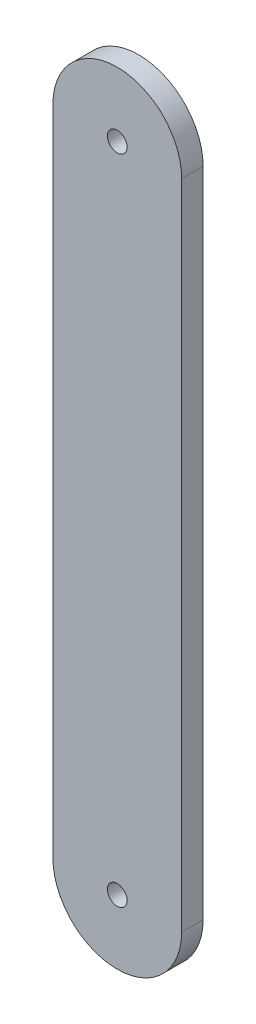
ISO-10303-21;
HEADER;
FILE_DESCRIPTION(('STEP AP214'),'2;1');
FILE_NAME('part.step','',(''),(''),'','','');
FILE_SCHEMA(('AUTOMOTIVE_DESIGN { 1 0 10303 214 1 1 1 1 }'));
ENDSEC;
DATA;
#1=APPLICATION_CONTEXT('core data for automotive mechanical design processes');
#2=APPLICATION_PROTOCOL_DEFINITION('international standard','automotive_design',2000,#1);
#3=PRODUCT_CONTEXT('',#1,'mechanical');
#4=PRODUCT('Part','Part','',(#3));
#5=PRODUCT_RELATED_PRODUCT_CATEGORY('part','',(#4));
#6=PRODUCT_DEFINITION_FORMATION('','',#4);
#7=PRODUCT_DEFINITION_CONTEXT('part definition',#1,'design');
#8=PRODUCT_DEFINITION('design','',#6,#7);
#9=PRODUCT_DEFINITION_SHAPE('','',#8);
#10=(LENGTH_UNIT() NAMED_UNIT(*) SI_UNIT(.MILLI.,.METRE.));
#11=(NAMED_UNIT(*) PLANE_ANGLE_UNIT() SI_UNIT($,.RADIAN.));
#12=(NAMED_UNIT(*) SI_UNIT($,.STERADIAN.) SOLID_ANGLE_UNIT());
#13=UNCERTAINTY_MEASURE_WITH_UNIT(LENGTH_MEASURE(1.E-05),#10,'distance_accuracy_value','');
#14=(GEOMETRIC_REPRESENTATION_CONTEXT(3) GLOBAL_UNCERTAINTY_ASSIGNED_CONTEXT((#13)) GLOBAL_UNIT_ASSIGNED_CONTEXT((#10,
#11,#12)) REPRESENTATION_CONTEXT('',''));
#15=CARTESIAN_POINT('',(0.,0.,0.));
#16=DIRECTION('',(0.,0.,1.));
#17=DIRECTION('',(1.,0.,0.));
#18=AXIS2_PLACEMENT_3D('',#15,#16,#17);
#19=CARTESIAN_POINT('',(-9.82801288749565,0.,3.175));
#20=DIRECTION('',(0.,0.,1.));
#21=DIRECTION('',(1.,0.,0.));
#22=AXIS2_PLACEMENT_3D('',#19,#20,#21);
#23=PLANE('',#22);
#24=CARTESIAN_POINT('',(-9.82801288749566,96.52,3.175));
#25=DIRECTION('',(0.,0.,1.));
#26=DIRECTION('',(1.,0.,0.));
#27=AXIS2_PLACEMENT_3D('',#24,#25,#26);
#28=CIRCLE('',#27,1.4605);
#29=CARTESIAN_POINT('',(-8.36751288749566,96.52,3.175));
#30=VERTEX_POINT('',#29);
#31=EDGE_CURVE('E100',#30,#30,#28,.T.);
#32=ORIENTED_EDGE('',*,*,#31,.F.);
#33=EDGE_LOOP('',(#32));
#34=FACE_BOUND('',#33,.T.);
#35=CARTESIAN_POINT('',(-9.82801288749565,0.,3.175));
#36=DIRECTION('',(0.,0.,1.));
#37=DIRECTION('',(1.,0.,0.));
#38=AXIS2_PLACEMENT_3D('',#35,#36,#37);
#39=CIRCLE('',#38,9.525);
#40=CARTESIAN_POINT('',(-19.3530128874956,0.,3.175));
#41=VERTEX_POINT('',#40);
#42=CARTESIAN_POINT('',(-0.30301288749565,0.,3.175));
#43=VERTEX_POINT('',#42);
#44=EDGE_CURVE('E85',#41,#43,#39,.T.);
#45=ORIENTED_EDGE('',*,*,#44,.T.);
#46=DIRECTION('',(0.,1.,0.));
#47=VECTOR('',#46,1.);
#48=CARTESIAN_POINT('',(-0.303012887495662,96.52,3.175));
#49=LINE('',#48,#47);
#50=CARTESIAN_POINT('',(-0.303012887495662,96.52,3.175));
#51=VERTEX_POINT('',#50);
#52=EDGE_CURVE('E80',#43,#51,#49,.T.);
#53=ORIENTED_EDGE('',*,*,#52,.T.);
#54=CARTESIAN_POINT('',(-9.82801288749566,96.52,3.175));
#55=DIRECTION('',(0.,0.,1.));
#56=DIRECTION('',(-1.,0.,0.));
#57=AXIS2_PLACEMENT_3D('',#54,#55,#56);
#58=CIRCLE('',#57,9.525);
#59=CARTESIAN_POINT('',(-19.3530128874957,96.52,3.175));
#60=VERTEX_POINT('',#59);
#61=EDGE_CURVE('E83',#51,#60,#58,.T.);
#62=ORIENTED_EDGE('',*,*,#61,.T.);
#63=DIRECTION('',(0.,-1.,0.));
#64=VECTOR('',#63,1.);
#65=CARTESIAN_POINT('',(-19.3530128874956,0.,3.175));
#66=LINE('',#65,#64);
#67=EDGE_CURVE('E50',#60,#41,#66,.T.);
#68=ORIENTED_EDGE('',*,*,#67,.T.);
#69=EDGE_LOOP('',(#45,#53,#62,#68));
#70=FACE_BOUND('',#69,.T.);
#71=CARTESIAN_POINT('',(-9.82801288749565,0.,3.175));
#72=DIRECTION('',(0.,0.,1.));
#73=DIRECTION('',(1.,0.,0.));
#74=AXIS2_PLACEMENT_3D('',#71,#72,#73);
#75=CIRCLE('',#74,1.4605);
#76=CARTESIAN_POINT('',(-8.36751288749565,0.,3.175));
#77=VERTEX_POINT('',#76);
#78=EDGE_CURVE('E115',#77,#77,#75,.T.);
#79=ORIENTED_EDGE('',*,*,#78,.F.);
#80=EDGE_LOOP('',(#79));
#81=FACE_BOUND('',#80,.T.);
#82=ADVANCED_FACE('F33',(#34,#70,#81),#23,.T.);
#83=CARTESIAN_POINT('',(-9.82801288749565,0.,0.));
#84=DIRECTION('',(0.,0.,1.));
#85=DIRECTION('',(1.,0.,0.));
#86=AXIS2_PLACEMENT_3D('',#83,#84,#85);
#87=PLANE('',#86);
#88=CARTESIAN_POINT('',(-9.82801288749565,0.,0.));
#89=DIRECTION('',(0.,0.,1.));
#90=DIRECTION('',(1.,0.,0.));
#91=AXIS2_PLACEMENT_3D('',#88,#89,#90);
#92=CIRCLE('',#91,9.525);
#93=CARTESIAN_POINT('',(-19.3530128874956,0.,0.));
#94=VERTEX_POINT('',#93);
#95=CARTESIAN_POINT('',(-0.30301288749565,0.,0.));
#96=VERTEX_POINT('',#95);
#97=EDGE_CURVE('E97',#94,#96,#92,.T.);
#98=ORIENTED_EDGE('',*,*,#97,.F.);
#99=DIRECTION('',(0.,-1.,0.));
#100=VECTOR('',#99,1.);
#101=CARTESIAN_POINT('',(-19.3530128874956,0.,0.));
#102=LINE('',#101,#100);
#103=CARTESIAN_POINT('',(-19.3530128874957,96.52,0.));
#104=VERTEX_POINT('',#103);
#105=EDGE_CURVE('E73',#104,#94,#102,.T.);
#106=ORIENTED_EDGE('',*,*,#105,.F.);
#107=CARTESIAN_POINT('',(-9.82801288749566,96.52,0.));
#108=DIRECTION('',(0.,0.,1.));
#109=DIRECTION('',(-1.,0.,0.));
#110=AXIS2_PLACEMENT_3D('',#107,#108,#109);
#111=CIRCLE('',#110,9.525);
#112=CARTESIAN_POINT('',(-0.303012887495662,96.52,0.));
#113=VERTEX_POINT('',#112);
#114=EDGE_CURVE('E67',#113,#104,#111,.T.);
#115=ORIENTED_EDGE('',*,*,#114,.F.);
#116=DIRECTION('',(0.,1.,0.));
#117=VECTOR('',#116,1.);
#118=CARTESIAN_POINT('',(-0.303012887495662,96.52,0.));
#119=LINE('',#118,#117);
#120=EDGE_CURVE('E89',#96,#113,#119,.T.);
#121=ORIENTED_EDGE('',*,*,#120,.F.);
#122=EDGE_LOOP('',(#98,#106,#115,#121));
#123=FACE_BOUND('',#122,.T.);
#124=CARTESIAN_POINT('',(-9.82801288749566,96.52,0.));
#125=DIRECTION('',(0.,0.,1.));
#126=DIRECTION('',(1.,0.,0.));
#127=AXIS2_PLACEMENT_3D('',#124,#125,#126);
#128=CIRCLE('',#127,1.4605);
#129=CARTESIAN_POINT('',(-8.36751288749566,96.52,0.));
#130=VERTEX_POINT('',#129);
#131=EDGE_CURVE('E112',#130,#130,#128,.T.);
#132=ORIENTED_EDGE('',*,*,#131,.T.);
#133=EDGE_LOOP('',(#132));
#134=FACE_BOUND('',#133,.T.);
#135=CARTESIAN_POINT('',(-9.82801288749565,0.,0.));
#136=DIRECTION('',(0.,0.,1.));
#137=DIRECTION('',(1.,0.,0.));
#138=AXIS2_PLACEMENT_3D('',#135,#136,#137);
#139=CIRCLE('',#138,1.4605);
#140=CARTESIAN_POINT('',(-8.36751288749565,0.,0.));
#141=VERTEX_POINT('',#140);
#142=EDGE_CURVE('E118',#141,#141,#139,.T.);
#143=ORIENTED_EDGE('',*,*,#142,.T.);
#144=EDGE_LOOP('',(#143));
#145=FACE_BOUND('',#144,.T.);
#146=ADVANCED_FACE('F108',(#123,#134,#145),#87,.F.);
#147=CARTESIAN_POINT('',(-9.82801288749565,0.,3.175));
#148=DIRECTION('',(0.,0.,-1.));
#149=DIRECTION('',(-1.,0.,0.));
#150=AXIS2_PLACEMENT_3D('',#147,#148,#149);
#151=CYLINDRICAL_SURFACE('',#150,9.525);
#152=ORIENTED_EDGE('',*,*,#97,.T.);
#153=DIRECTION('',(0.,0.,-1.));
#154=VECTOR('',#153,1.);
#155=CARTESIAN_POINT('',(-0.30301288749565,0.,3.175));
#156=LINE('',#155,#154);
#157=EDGE_CURVE('E11',#43,#96,#156,.T.);
#158=ORIENTED_EDGE('',*,*,#157,.F.);
#159=ORIENTED_EDGE('',*,*,#44,.F.);
#160=DIRECTION('',(0.,0.,-1.));
#161=VECTOR('',#160,1.);
#162=CARTESIAN_POINT('',(-19.3530128874956,0.,3.175));
#163=LINE('',#162,#161);
#164=EDGE_CURVE('E93',#41,#94,#163,.T.);
#165=ORIENTED_EDGE('',*,*,#164,.T.);
#166=EDGE_LOOP('',(#152,#158,#159,#165));
#167=FACE_BOUND('',#166,.T.);
#168=ADVANCED_FACE('F35',(#167),#151,.T.);
#169=CARTESIAN_POINT('',(-0.303012887495662,96.52,3.175));
#170=DIRECTION('',(-1.,0.,0.));
#171=DIRECTION('',(0.,-1.,0.));
#172=AXIS2_PLACEMENT_3D('',#169,#170,#171);
#173=PLANE('',#172);
#174=ORIENTED_EDGE('',*,*,#120,.T.);
#175=DIRECTION('',(0.,0.,-1.));
#176=VECTOR('',#175,1.);
#177=CARTESIAN_POINT('',(-0.303012887495662,96.52,3.175));
#178=LINE('',#177,#176);
#179=EDGE_CURVE('E42',#51,#113,#178,.T.);
#180=ORIENTED_EDGE('',*,*,#179,.F.);
#181=ORIENTED_EDGE('',*,*,#52,.F.);
#182=ORIENTED_EDGE('',*,*,#157,.T.);
#183=EDGE_LOOP('',(#174,#180,#181,#182));
#184=FACE_BOUND('',#183,.T.);
#185=ADVANCED_FACE('F88',(#184),#173,.F.);
#186=CARTESIAN_POINT('',(-9.82801288749566,96.52,3.175));
#187=DIRECTION('',(0.,0.,-1.));
#188=DIRECTION('',(-1.,0.,0.));
#189=AXIS2_PLACEMENT_3D('',#186,#187,#188);
#190=CYLINDRICAL_SURFACE('',#189,9.525);
#191=ORIENTED_EDGE('',*,*,#114,.T.);
#192=DIRECTION('',(0.,0.,-1.));
#193=VECTOR('',#192,1.);
#194=CARTESIAN_POINT('',(-19.3530128874957,96.52,3.175));
#195=LINE('',#194,#193);
#196=EDGE_CURVE('E90',#60,#104,#195,.T.);
#197=ORIENTED_EDGE('',*,*,#196,.F.);
#198=ORIENTED_EDGE('',*,*,#61,.F.);
#199=ORIENTED_EDGE('',*,*,#179,.T.);
#200=EDGE_LOOP('',(#191,#197,#198,#199));
#201=FACE_BOUND('',#200,.T.);
#202=ADVANCED_FACE('F91',(#201),#190,.T.);
#203=CARTESIAN_POINT('',(-19.3530128874956,0.,3.175));
#204=DIRECTION('',(1.,0.,0.));
#205=DIRECTION('',(0.,1.,0.));
#206=AXIS2_PLACEMENT_3D('',#203,#204,#205);
#207=PLANE('',#206);
#208=ORIENTED_EDGE('',*,*,#105,.T.);
#209=ORIENTED_EDGE('',*,*,#164,.F.);
#210=ORIENTED_EDGE('',*,*,#67,.F.);
#211=ORIENTED_EDGE('',*,*,#196,.T.);
#212=EDGE_LOOP('',(#208,#209,#210,#211));
#213=FACE_BOUND('',#212,.T.);
#214=ADVANCED_FACE('F105',(#213),#207,.F.);
#215=CARTESIAN_POINT('',(-9.82801288749566,96.52,3.175));
#216=DIRECTION('',(0.,0.,-1.));
#217=DIRECTION('',(-1.,0.,0.));
#218=AXIS2_PLACEMENT_3D('',#215,#216,#217);
#219=CYLINDRICAL_SURFACE('',#218,1.4605);
#220=ORIENTED_EDGE('',*,*,#31,.T.);
#221=EDGE_LOOP('',(#220));
#222=FACE_BOUND('',#221,.T.);
#223=ORIENTED_EDGE('',*,*,#131,.F.);
#224=EDGE_LOOP('',(#223));
#225=FACE_BOUND('',#224,.T.);
#226=ADVANCED_FACE('F135',(#222,#225),#219,.F.);
#227=CARTESIAN_POINT('',(-9.82801288749565,0.,3.175));
#228=DIRECTION('',(0.,0.,-1.));
#229=DIRECTION('',(-1.,0.,0.));
#230=AXIS2_PLACEMENT_3D('',#227,#228,#229);
#231=CYLINDRICAL_SURFACE('',#230,1.4605);
#232=ORIENTED_EDGE('',*,*,#78,.T.);
#233=EDGE_LOOP('',(#232));
#234=FACE_BOUND('',#233,.T.);
#235=ORIENTED_EDGE('',*,*,#142,.F.);
#236=EDGE_LOOP('',(#235));
#237=FACE_BOUND('',#236,.T.);
#238=ADVANCED_FACE('F124',(#234,#237),#231,.F.);
#239=CLOSED_SHELL('',(#82,#146,#168,#185,#202,#214,#226,#238));
#240=MANIFOLD_SOLID_BREP('B2',#239);
#241=ADVANCED_BREP_SHAPE_REPRESENTATION('',(#18,#240),#14);
#242=SHAPE_DEFINITION_REPRESENTATION(#9,#241);
ENDSEC;
END-ISO-10303-21;
